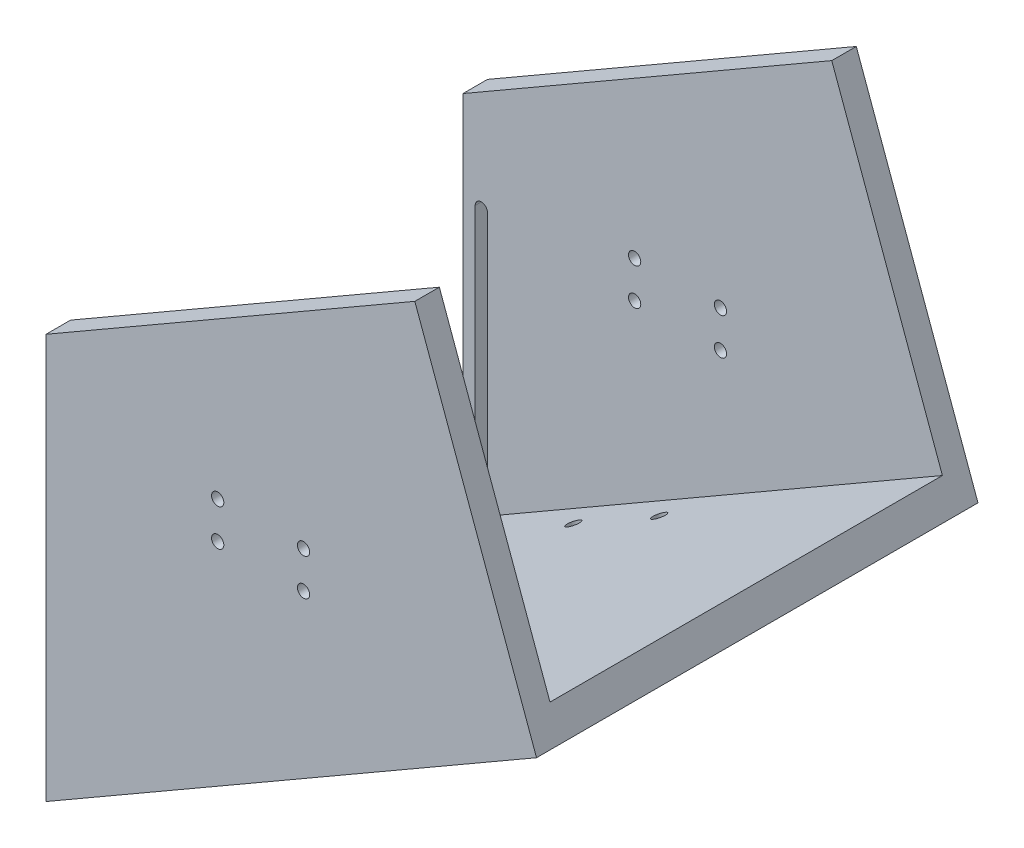
ISO-10303-21;
HEADER;
FILE_DESCRIPTION(('STEP AP214'),'2;1');
FILE_NAME('part.step','',(''),(''),'','','');
FILE_SCHEMA(('AUTOMOTIVE_DESIGN { 1 0 10303 214 1 1 1 1 }'));
ENDSEC;
DATA;
#1=APPLICATION_CONTEXT('core data for automotive mechanical design processes');
#2=APPLICATION_PROTOCOL_DEFINITION('international standard','automotive_design',2000,#1);
#3=PRODUCT_CONTEXT('',#1,'mechanical');
#4=PRODUCT('Part','Part','',(#3));
#5=PRODUCT_RELATED_PRODUCT_CATEGORY('part','',(#4));
#6=PRODUCT_DEFINITION_FORMATION('','',#4);
#7=PRODUCT_DEFINITION_CONTEXT('part definition',#1,'design');
#8=PRODUCT_DEFINITION('design','',#6,#7);
#9=PRODUCT_DEFINITION_SHAPE('','',#8);
#10=(LENGTH_UNIT() NAMED_UNIT(*) SI_UNIT(.MILLI.,.METRE.));
#11=(NAMED_UNIT(*) PLANE_ANGLE_UNIT() SI_UNIT($,.RADIAN.));
#12=(NAMED_UNIT(*) SI_UNIT($,.STERADIAN.) SOLID_ANGLE_UNIT());
#13=UNCERTAINTY_MEASURE_WITH_UNIT(LENGTH_MEASURE(1.E-05),#10,'distance_accuracy_value','');
#14=(GEOMETRIC_REPRESENTATION_CONTEXT(3) GLOBAL_UNCERTAINTY_ASSIGNED_CONTEXT((#13)) GLOBAL_UNIT_ASSIGNED_CONTEXT((#10,
#11,#12)) REPRESENTATION_CONTEXT('',''));
#15=CARTESIAN_POINT('',(0.,0.,0.));
#16=DIRECTION('',(0.,0.,1.));
#17=DIRECTION('',(1.,0.,0.));
#18=AXIS2_PLACEMENT_3D('',#15,#16,#17);
#19=CARTESIAN_POINT('',(0.,0.,80.));
#20=DIRECTION('',(0.,0.,-1.));
#21=DIRECTION('',(-1.,0.,0.));
#22=AXIS2_PLACEMENT_3D('',#19,#20,#21);
#23=PLANE('',#22);
#24=CARTESIAN_POINT('',(-130.,11.3480506849568,80.));
#25=DIRECTION('',(0.,0.,-1.));
#26=DIRECTION('',(-1.,0.,0.));
#27=AXIS2_PLACEMENT_3D('',#24,#25,#26);
#28=CIRCLE('',#27,2.5);
#29=CARTESIAN_POINT('',(-132.5,11.3480506849568,80.));
#30=VERTEX_POINT('',#29);
#31=EDGE_CURVE('E238',#30,#30,#28,.T.);
#32=ORIENTED_EDGE('',*,*,#31,.F.);
#33=EDGE_LOOP('',(#32));
#34=FACE_BOUND('',#33,.T.);
#35=CARTESIAN_POINT('',(-94.9999999999999,26.3480506849568,80.));
#36=DIRECTION('',(0.,0.,-1.));
#37=DIRECTION('',(-1.,0.,0.));
#38=AXIS2_PLACEMENT_3D('',#35,#36,#37);
#39=CIRCLE('',#38,2.5);
#40=CARTESIAN_POINT('',(-97.4999999999999,26.3480506849568,80.));
#41=VERTEX_POINT('',#40);
#42=EDGE_CURVE('E267',#41,#41,#39,.T.);
#43=ORIENTED_EDGE('',*,*,#42,.F.);
#44=EDGE_LOOP('',(#43));
#45=FACE_BOUND('',#44,.T.);
#46=CARTESIAN_POINT('',(-130.,26.3480506849568,80.));
#47=DIRECTION('',(0.,0.,-1.));
#48=DIRECTION('',(-1.,0.,0.));
#49=AXIS2_PLACEMENT_3D('',#46,#47,#48);
#50=CIRCLE('',#49,2.5);
#51=CARTESIAN_POINT('',(-132.5,26.3480506849568,80.));
#52=VERTEX_POINT('',#51);
#53=EDGE_CURVE('E263',#52,#52,#50,.T.);
#54=ORIENTED_EDGE('',*,*,#53,.F.);
#55=EDGE_LOOP('',(#54));
#56=FACE_BOUND('',#55,.T.);
#57=CARTESIAN_POINT('',(-94.9999999999999,11.3480506849568,80.));
#58=DIRECTION('',(0.,0.,-1.));
#59=DIRECTION('',(-1.,0.,0.));
#60=AXIS2_PLACEMENT_3D('',#57,#58,#59);
#61=CIRCLE('',#60,2.49999999999999);
#62=CARTESIAN_POINT('',(-97.4999999999999,11.3480506849568,80.));
#63=VERTEX_POINT('',#62);
#64=EDGE_CURVE('E258',#63,#63,#61,.T.);
#65=ORIENTED_EDGE('',*,*,#64,.F.);
#66=EDGE_LOOP('',(#65));
#67=FACE_BOUND('',#66,.T.);
#68=DIRECTION('',(-0.342020143325665,0.93969262078591,0.));
#69=VECTOR('',#68,1.);
#70=CARTESIAN_POINT('',(0.,0.,80.));
#71=LINE('',#70,#69);
#72=CARTESIAN_POINT('',(-4.511511995413,12.395277334996,80.));
#73=VERTEX_POINT('',#72);
#74=CARTESIAN_POINT('',(-49.6266319495432,136.348050684957,79.9999999999999));
#75=VERTEX_POINT('',#74);
#76=EDGE_CURVE('E304',#73,#75,#71,.T.);
#77=ORIENTED_EDGE('',*,*,#76,.F.);
#78=DIRECTION('',(0.866025403784436,0.500000000000004,0.));
#79=VECTOR('',#78,1.);
#80=CARTESIAN_POINT('',(0.,15.,80.));
#81=LINE('',#80,#79);
#82=CARTESIAN_POINT('',(-200.,-100.470053837926,80.));
#83=VERTEX_POINT('',#82);
#84=EDGE_CURVE('E389',#83,#73,#81,.T.);
#85=ORIENTED_EDGE('',*,*,#84,.F.);
#86=DIRECTION('',(0.,-1.,0.));
#87=VECTOR('',#86,1.);
#88=CARTESIAN_POINT('',(-200.,-100.470053837926,80.));
#89=LINE('',#88,#87);
#90=CARTESIAN_POINT('',(-200.,49.5299461620734,80.));
#91=VERTEX_POINT('',#90);
#92=EDGE_CURVE('E385',#91,#83,#89,.T.);
#93=ORIENTED_EDGE('',*,*,#92,.F.);
#94=DIRECTION('',(-0.866025403784436,-0.500000000000004,0.));
#95=VECTOR('',#94,1.);
#96=CARTESIAN_POINT('',(-200.,49.5299461620734,80.));
#97=LINE('',#96,#95);
#98=EDGE_CURVE('E382',#75,#91,#97,.T.);
#99=ORIENTED_EDGE('',*,*,#98,.F.);
#100=EDGE_LOOP('',(#77,#85,#93,#99));
#101=FACE_BOUND('',#100,.T.);
#102=DIRECTION('',(0.,1.,0.));
#103=VECTOR('',#102,1.);
#104=CARTESIAN_POINT('',(-190.,0.,80.));
#105=LINE('',#104,#103);
#106=CARTESIAN_POINT('',(-190.,-87.4796727811599,80.));
#107=VERTEX_POINT('',#106);
#108=CARTESIAN_POINT('',(-190.,12.5203272188401,80.));
#109=VERTEX_POINT('',#108);
#110=EDGE_CURVE('E218',#107,#109,#105,.T.);
#111=ORIENTED_EDGE('',*,*,#110,.T.);
#112=CARTESIAN_POINT('',(-192.5,12.5203272188401,80.));
#113=DIRECTION('',(0.,0.,-1.));
#114=DIRECTION('',(-1.,0.,0.));
#115=AXIS2_PLACEMENT_3D('',#112,#113,#114);
#116=CIRCLE('',#115,2.5);
#117=CARTESIAN_POINT('',(-195.,12.5203272188401,80.));
#118=VERTEX_POINT('',#117);
#119=EDGE_CURVE('E59',#109,#118,#116,.F.);
#120=ORIENTED_EDGE('',*,*,#119,.T.);
#121=DIRECTION('',(0.,-1.,0.));
#122=VECTOR('',#121,1.);
#123=CARTESIAN_POINT('',(-195.,0.,80.));
#124=LINE('',#123,#122);
#125=CARTESIAN_POINT('',(-195.,-87.4796727811599,80.));
#126=VERTEX_POINT('',#125);
#127=EDGE_CURVE('E226',#118,#126,#124,.T.);
#128=ORIENTED_EDGE('',*,*,#127,.T.);
#129=CARTESIAN_POINT('',(-192.5,-87.4796727811599,80.));
#130=DIRECTION('',(0.,0.,-1.));
#131=DIRECTION('',(-1.,0.,0.));
#132=AXIS2_PLACEMENT_3D('',#129,#130,#131);
#133=CIRCLE('',#132,2.50000000000003);
#134=EDGE_CURVE('E222',#126,#107,#133,.F.);
#135=ORIENTED_EDGE('',*,*,#134,.T.);
#136=EDGE_LOOP('',(#111,#120,#128,#135));
#137=FACE_BOUND('',#136,.T.);
#138=ADVANCED_FACE('F49',(#34,#45,#56,#67,#101,#137),#23,.T.);
#139=CARTESIAN_POINT('',(0.,15.,-90.));
#140=DIRECTION('',(0.,0.,-1.));
#141=DIRECTION('',(-1.,0.,0.));
#142=AXIS2_PLACEMENT_3D('',#139,#140,#141);
#143=PLANE('',#142);
#144=CARTESIAN_POINT('',(-130.,11.3480506849568,-90.));
#145=DIRECTION('',(0.,0.,-1.));
#146=DIRECTION('',(-1.,0.,0.));
#147=AXIS2_PLACEMENT_3D('',#144,#145,#146);
#148=CIRCLE('',#147,2.5);
#149=CARTESIAN_POINT('',(-132.5,11.3480506849568,-90.));
#150=VERTEX_POINT('',#149);
#151=EDGE_CURVE('E454',#150,#150,#148,.T.);
#152=ORIENTED_EDGE('',*,*,#151,.F.);
#153=EDGE_LOOP('',(#152));
#154=FACE_BOUND('',#153,.T.);
#155=CARTESIAN_POINT('',(-94.9999999999999,26.3480506849568,-90.));
#156=DIRECTION('',(0.,0.,-1.));
#157=DIRECTION('',(-1.,0.,0.));
#158=AXIS2_PLACEMENT_3D('',#155,#156,#157);
#159=CIRCLE('',#158,2.5);
#160=CARTESIAN_POINT('',(-97.4999999999999,26.3480506849568,-90.));
#161=VERTEX_POINT('',#160);
#162=EDGE_CURVE('E467',#161,#161,#159,.T.);
#163=ORIENTED_EDGE('',*,*,#162,.F.);
#164=EDGE_LOOP('',(#163));
#165=FACE_BOUND('',#164,.T.);
#166=CARTESIAN_POINT('',(-130.,26.3480506849568,-90.));
#167=DIRECTION('',(0.,0.,-1.));
#168=DIRECTION('',(-1.,0.,0.));
#169=AXIS2_PLACEMENT_3D('',#166,#167,#168);
#170=CIRCLE('',#169,2.5);
#171=CARTESIAN_POINT('',(-132.5,26.3480506849568,-90.));
#172=VERTEX_POINT('',#171);
#173=EDGE_CURVE('E468',#172,#172,#170,.T.);
#174=ORIENTED_EDGE('',*,*,#173,.F.);
#175=EDGE_LOOP('',(#174));
#176=FACE_BOUND('',#175,.T.);
#177=CARTESIAN_POINT('',(-94.9999999999999,11.3480506849568,-90.));
#178=DIRECTION('',(0.,0.,-1.));
#179=DIRECTION('',(-1.,0.,0.));
#180=AXIS2_PLACEMENT_3D('',#177,#178,#179);
#181=CIRCLE('',#180,2.49999999999999);
#182=CARTESIAN_POINT('',(-97.4999999999999,11.3480506849568,-90.));
#183=VERTEX_POINT('',#182);
#184=EDGE_CURVE('E451',#183,#183,#181,.T.);
#185=ORIENTED_EDGE('',*,*,#184,.F.);
#186=EDGE_LOOP('',(#185));
#187=FACE_BOUND('',#186,.T.);
#188=DIRECTION('',(0.342020143325665,-0.93969262078591,0.));
#189=VECTOR('',#188,1.);
#190=CARTESIAN_POINT('',(-49.6266319495432,136.348050684957,-90.));
#191=LINE('',#190,#189);
#192=CARTESIAN_POINT('',(-49.6266319495432,136.348050684957,-90.));
#193=VERTEX_POINT('',#192);
#194=CARTESIAN_POINT('',(0.,0.,-90.));
#195=VERTEX_POINT('',#194);
#196=EDGE_CURVE('E165',#193,#195,#191,.T.);
#197=ORIENTED_EDGE('',*,*,#196,.T.);
#198=DIRECTION('',(0.866025403784436,0.500000000000004,0.));
#199=VECTOR('',#198,1.);
#200=CARTESIAN_POINT('',(0.,0.,-90.));
#201=LINE('',#200,#199);
#202=CARTESIAN_POINT('',(-200.,-115.470053837926,-90.));
#203=VERTEX_POINT('',#202);
#204=EDGE_CURVE('E180',#203,#195,#201,.T.);
#205=ORIENTED_EDGE('',*,*,#204,.F.);
#206=DIRECTION('',(0.,-1.,0.));
#207=VECTOR('',#206,1.);
#208=CARTESIAN_POINT('',(-200.,-100.470053837926,-90.));
#209=LINE('',#208,#207);
#210=CARTESIAN_POINT('',(-200.,49.5299461620734,-90.));
#211=VERTEX_POINT('',#210);
#212=EDGE_CURVE('E191',#211,#203,#209,.T.);
#213=ORIENTED_EDGE('',*,*,#212,.F.);
#214=DIRECTION('',(-0.866025403784436,-0.500000000000004,0.));
#215=VECTOR('',#214,1.);
#216=CARTESIAN_POINT('',(-200.,49.5299461620734,-90.));
#217=LINE('',#216,#215);
#218=EDGE_CURVE('E181',#193,#211,#217,.T.);
#219=ORIENTED_EDGE('',*,*,#218,.F.);
#220=EDGE_LOOP('',(#197,#205,#213,#219));
#221=FACE_BOUND('',#220,.T.);
#222=ADVANCED_FACE('F51',(#154,#165,#176,#187,#221),#143,.T.);
#223=CARTESIAN_POINT('',(0.,15.,90.));
#224=DIRECTION('',(0.,0.,-1.));
#225=DIRECTION('',(-1.,0.,0.));
#226=AXIS2_PLACEMENT_3D('',#223,#224,#225);
#227=PLANE('',#226);
#228=CARTESIAN_POINT('',(-130.,11.3480506849568,90.));
#229=DIRECTION('',(0.,0.,-1.));
#230=DIRECTION('',(-1.,0.,0.));
#231=AXIS2_PLACEMENT_3D('',#228,#229,#230);
#232=CIRCLE('',#231,2.5);
#233=CARTESIAN_POINT('',(-132.5,11.3480506849568,90.));
#234=VERTEX_POINT('',#233);
#235=EDGE_CURVE('E460',#234,#234,#232,.T.);
#236=ORIENTED_EDGE('',*,*,#235,.T.);
#237=EDGE_LOOP('',(#236));
#238=FACE_BOUND('',#237,.T.);
#239=CARTESIAN_POINT('',(-94.9999999999999,26.3480506849568,90.));
#240=DIRECTION('',(0.,0.,-1.));
#241=DIRECTION('',(-1.,0.,0.));
#242=AXIS2_PLACEMENT_3D('',#239,#240,#241);
#243=CIRCLE('',#242,2.5);
#244=CARTESIAN_POINT('',(-97.4999999999999,26.3480506849568,90.));
#245=VERTEX_POINT('',#244);
#246=EDGE_CURVE('E463',#245,#245,#243,.T.);
#247=ORIENTED_EDGE('',*,*,#246,.T.);
#248=EDGE_LOOP('',(#247));
#249=FACE_BOUND('',#248,.T.);
#250=CARTESIAN_POINT('',(-130.,26.3480506849568,90.));
#251=DIRECTION('',(0.,0.,-1.));
#252=DIRECTION('',(-1.,0.,0.));
#253=AXIS2_PLACEMENT_3D('',#250,#251,#252);
#254=CIRCLE('',#253,2.5);
#255=CARTESIAN_POINT('',(-132.5,26.3480506849568,90.));
#256=VERTEX_POINT('',#255);
#257=EDGE_CURVE('E475',#256,#256,#254,.T.);
#258=ORIENTED_EDGE('',*,*,#257,.T.);
#259=EDGE_LOOP('',(#258));
#260=FACE_BOUND('',#259,.T.);
#261=CARTESIAN_POINT('',(-94.9999999999999,11.3480506849568,90.));
#262=DIRECTION('',(0.,0.,-1.));
#263=DIRECTION('',(-1.,0.,0.));
#264=AXIS2_PLACEMENT_3D('',#261,#262,#263);
#265=CIRCLE('',#264,2.49999999999999);
#266=CARTESIAN_POINT('',(-97.4999999999999,11.3480506849568,90.));
#267=VERTEX_POINT('',#266);
#268=EDGE_CURVE('E259',#267,#267,#265,.T.);
#269=ORIENTED_EDGE('',*,*,#268,.T.);
#270=EDGE_LOOP('',(#269));
#271=FACE_BOUND('',#270,.T.);
#272=DIRECTION('',(0.866025403784436,0.500000000000004,0.));
#273=VECTOR('',#272,1.);
#274=CARTESIAN_POINT('',(0.,0.,90.));
#275=LINE('',#274,#273);
#276=CARTESIAN_POINT('',(-200.,-115.470053837926,90.));
#277=VERTEX_POINT('',#276);
#278=CARTESIAN_POINT('',(0.,0.,90.));
#279=VERTEX_POINT('',#278);
#280=EDGE_CURVE('E195',#277,#279,#275,.T.);
#281=ORIENTED_EDGE('',*,*,#280,.T.);
#282=DIRECTION('',(0.342020143325665,-0.93969262078591,0.));
#283=VECTOR('',#282,1.);
#284=CARTESIAN_POINT('',(-49.6266319495432,136.348050684957,90.));
#285=LINE('',#284,#283);
#286=CARTESIAN_POINT('',(-49.6266319495432,136.348050684957,90.));
#287=VERTEX_POINT('',#286);
#288=EDGE_CURVE('E167',#287,#279,#285,.T.);
#289=ORIENTED_EDGE('',*,*,#288,.F.);
#290=DIRECTION('',(-0.866025403784436,-0.500000000000004,0.));
#291=VECTOR('',#290,1.);
#292=CARTESIAN_POINT('',(-200.,49.5299461620734,90.));
#293=LINE('',#292,#291);
#294=CARTESIAN_POINT('',(-200.,49.5299461620734,90.));
#295=VERTEX_POINT('',#294);
#296=EDGE_CURVE('E381',#287,#295,#293,.T.);
#297=ORIENTED_EDGE('',*,*,#296,.T.);
#298=DIRECTION('',(0.,-1.,0.));
#299=VECTOR('',#298,1.);
#300=CARTESIAN_POINT('',(-200.,-100.470053837926,90.));
#301=LINE('',#300,#299);
#302=EDGE_CURVE('E190',#295,#277,#301,.T.);
#303=ORIENTED_EDGE('',*,*,#302,.T.);
#304=EDGE_LOOP('',(#281,#289,#297,#303));
#305=FACE_BOUND('',#304,.T.);
#306=ADVANCED_FACE('F399',(#238,#249,#260,#271,#305),#227,.F.);
#307=CARTESIAN_POINT('',(0.,15.,90.));
#308=DIRECTION('',(0.500000000000004,-0.866025403784436,0.));
#309=DIRECTION('',(0.866025403784436,0.500000000000004,0.));
#310=AXIS2_PLACEMENT_3D('',#307,#308,#309);
#311=PLANE('',#310);
#312=CARTESIAN_POINT('',(-107.5,-47.0651539378855,-67.5));
#313=DIRECTION('',(0.500000000000004,-0.866025403784436,0.));
#314=DIRECTION('',(0.866025403784436,0.500000000000004,0.));
#315=AXIS2_PLACEMENT_3D('',#312,#313,#314);
#316=ELLIPSE('',#315,2.88675134594813,2.5);
#317=CARTESIAN_POINT('',(-105.,-45.6217782649114,-67.5));
#318=VERTEX_POINT('',#317);
#319=EDGE_CURVE('E253',#318,#318,#316,.T.);
#320=ORIENTED_EDGE('',*,*,#319,.T.);
#321=EDGE_LOOP('',(#320));
#322=FACE_BOUND('',#321,.T.);
#323=CARTESIAN_POINT('',(-142.5,-67.2724133595226,67.5));
#324=DIRECTION('',(0.500000000000004,-0.866025403784436,0.));
#325=DIRECTION('',(0.866025403784436,0.500000000000004,0.));
#326=AXIS2_PLACEMENT_3D('',#323,#324,#325);
#327=ELLIPSE('',#326,2.88675134594813,2.5);
#328=CARTESIAN_POINT('',(-140.,-65.8290376865485,67.5));
#329=VERTEX_POINT('',#328);
#330=EDGE_CURVE('E248',#329,#329,#327,.T.);
#331=ORIENTED_EDGE('',*,*,#330,.T.);
#332=EDGE_LOOP('',(#331));
#333=FACE_BOUND('',#332,.T.);
#334=CARTESIAN_POINT('',(-107.5,-47.0651539378855,67.5));
#335=DIRECTION('',(0.500000000000004,-0.866025403784436,0.));
#336=DIRECTION('',(0.866025403784436,0.500000000000004,0.));
#337=AXIS2_PLACEMENT_3D('',#334,#335,#336);
#338=ELLIPSE('',#337,2.88675134594813,2.5);
#339=CARTESIAN_POINT('',(-105.,-45.6217782649114,67.5));
#340=VERTEX_POINT('',#339);
#341=EDGE_CURVE('E243',#340,#340,#338,.T.);
#342=ORIENTED_EDGE('',*,*,#341,.T.);
#343=EDGE_LOOP('',(#342));
#344=FACE_BOUND('',#343,.T.);
#345=CARTESIAN_POINT('',(-142.5,-67.2724133595226,-67.5));
#346=DIRECTION('',(0.500000000000004,-0.866025403784436,0.));
#347=DIRECTION('',(0.866025403784436,0.500000000000004,0.));
#348=AXIS2_PLACEMENT_3D('',#345,#346,#347);
#349=ELLIPSE('',#348,2.88675134594813,2.5);
#350=CARTESIAN_POINT('',(-140.,-65.8290376865485,-67.5));
#351=VERTEX_POINT('',#350);
#352=EDGE_CURVE('E237',#351,#351,#349,.T.);
#353=ORIENTED_EDGE('',*,*,#352,.T.);
#354=EDGE_LOOP('',(#353));
#355=FACE_BOUND('',#354,.T.);
#356=ORIENTED_EDGE('',*,*,#84,.T.);
#357=DIRECTION('',(0.,0.,-1.));
#358=VECTOR('',#357,1.);
#359=CARTESIAN_POINT('',(-4.511511995413,12.395277334996,90.));
#360=LINE('',#359,#358);
#361=CARTESIAN_POINT('',(-4.511511995413,12.395277334996,-80.));
#362=VERTEX_POINT('',#361);
#363=EDGE_CURVE('E300',#73,#362,#360,.T.);
#364=ORIENTED_EDGE('',*,*,#363,.T.);
#365=DIRECTION('',(0.866025403784436,0.500000000000004,0.));
#366=VECTOR('',#365,1.);
#367=CARTESIAN_POINT('',(0.,15.,-80.));
#368=LINE('',#367,#366);
#369=CARTESIAN_POINT('',(-200.,-100.470053837926,-80.));
#370=VERTEX_POINT('',#369);
#371=EDGE_CURVE('E365',#370,#362,#368,.T.);
#372=ORIENTED_EDGE('',*,*,#371,.F.);
#373=DIRECTION('',(0.,0.,-1.));
#374=VECTOR('',#373,1.);
#375=CARTESIAN_POINT('',(-200.,-100.470053837926,90.));
#376=LINE('',#375,#374);
#377=EDGE_CURVE('E174',#83,#370,#376,.T.);
#378=ORIENTED_EDGE('',*,*,#377,.F.);
#379=EDGE_LOOP('',(#356,#364,#372,#378));
#380=FACE_BOUND('',#379,.T.);
#381=ADVANCED_FACE('F416',(#322,#333,#344,#355,#380),#311,.F.);
#382=CARTESIAN_POINT('',(-200.,-100.470053837926,90.));
#383=DIRECTION('',(1.,0.,0.));
#384=DIRECTION('',(0.,1.,0.));
#385=AXIS2_PLACEMENT_3D('',#382,#383,#384);
#386=PLANE('',#385);
#387=ORIENTED_EDGE('',*,*,#212,.T.);
#388=DIRECTION('',(0.,0.,-1.));
#389=VECTOR('',#388,1.);
#390=CARTESIAN_POINT('',(-200.,-115.470053837926,90.));
#391=LINE('',#390,#389);
#392=EDGE_CURVE('E188',#277,#203,#391,.T.);
#393=ORIENTED_EDGE('',*,*,#392,.F.);
#394=ORIENTED_EDGE('',*,*,#302,.F.);
#395=DIRECTION('',(0.,0.,1.));
#396=VECTOR('',#395,1.);
#397=CARTESIAN_POINT('',(-200.,49.5299461620734,80.));
#398=LINE('',#397,#396);
#399=EDGE_CURVE('E197',#91,#295,#398,.T.);
#400=ORIENTED_EDGE('',*,*,#399,.F.);
#401=ORIENTED_EDGE('',*,*,#92,.T.);
#402=ORIENTED_EDGE('',*,*,#377,.T.);
#403=DIRECTION('',(0.,-1.,0.));
#404=VECTOR('',#403,1.);
#405=CARTESIAN_POINT('',(-200.,-100.470053837926,-80.));
#406=LINE('',#405,#404);
#407=CARTESIAN_POINT('',(-200.,49.5299461620734,-80.));
#408=VERTEX_POINT('',#407);
#409=EDGE_CURVE('E369',#408,#370,#406,.T.);
#410=ORIENTED_EDGE('',*,*,#409,.F.);
#411=DIRECTION('',(0.,0.,-1.));
#412=VECTOR('',#411,1.);
#413=CARTESIAN_POINT('',(-200.,49.5299461620734,-80.));
#414=LINE('',#413,#412);
#415=EDGE_CURVE('E375',#408,#211,#414,.T.);
#416=ORIENTED_EDGE('',*,*,#415,.T.);
#417=EDGE_LOOP('',(#387,#393,#394,#400,#401,#402,#410,#416));
#418=FACE_BOUND('',#417,.T.);
#419=ADVANCED_FACE('F404',(#418),#386,.F.);
#420=CARTESIAN_POINT('',(0.,0.,90.));
#421=DIRECTION('',(-0.500000000000004,0.866025403784436,0.));
#422=DIRECTION('',(-0.866025403784436,-0.500000000000004,0.));
#423=AXIS2_PLACEMENT_3D('',#420,#421,#422);
#424=PLANE('',#423);
#425=CARTESIAN_POINT('',(-107.5,-62.0651539378855,-67.5));
#426=DIRECTION('',(-0.500000000000004,0.866025403784436,0.));
#427=DIRECTION('',(0.866025403784436,0.500000000000004,0.));
#428=AXIS2_PLACEMENT_3D('',#425,#426,#427);
#429=ELLIPSE('',#428,2.88675134594813,2.5);
#430=CARTESIAN_POINT('',(-105.,-60.6217782649114,-67.5));
#431=VERTEX_POINT('',#430);
#432=EDGE_CURVE('E249',#431,#431,#429,.T.);
#433=ORIENTED_EDGE('',*,*,#432,.T.);
#434=EDGE_LOOP('',(#433));
#435=FACE_BOUND('',#434,.T.);
#436=CARTESIAN_POINT('',(-142.5,-82.2724133595226,67.5));
#437=DIRECTION('',(-0.500000000000004,0.866025403784436,0.));
#438=DIRECTION('',(0.866025403784436,0.500000000000004,0.));
#439=AXIS2_PLACEMENT_3D('',#436,#437,#438);
#440=ELLIPSE('',#439,2.88675134594813,2.5);
#441=CARTESIAN_POINT('',(-140.,-80.8290376865485,67.5));
#442=VERTEX_POINT('',#441);
#443=EDGE_CURVE('E244',#442,#442,#440,.T.);
#444=ORIENTED_EDGE('',*,*,#443,.T.);
#445=EDGE_LOOP('',(#444));
#446=FACE_BOUND('',#445,.T.);
#447=CARTESIAN_POINT('',(-107.5,-62.0651539378855,67.5));
#448=DIRECTION('',(-0.500000000000004,0.866025403784436,0.));
#449=DIRECTION('',(0.866025403784436,0.500000000000004,0.));
#450=AXIS2_PLACEMENT_3D('',#447,#448,#449);
#451=ELLIPSE('',#450,2.88675134594813,2.5);
#452=CARTESIAN_POINT('',(-105.,-60.6217782649114,67.5));
#453=VERTEX_POINT('',#452);
#454=EDGE_CURVE('E239',#453,#453,#451,.T.);
#455=ORIENTED_EDGE('',*,*,#454,.T.);
#456=EDGE_LOOP('',(#455));
#457=FACE_BOUND('',#456,.T.);
#458=CARTESIAN_POINT('',(-142.5,-82.2724133595226,-67.5));
#459=DIRECTION('',(-0.500000000000004,0.866025403784436,0.));
#460=DIRECTION('',(0.866025403784436,0.500000000000004,0.));
#461=AXIS2_PLACEMENT_3D('',#458,#459,#460);
#462=ELLIPSE('',#461,2.88675134594813,2.5);
#463=CARTESIAN_POINT('',(-140.,-80.8290376865485,-67.5));
#464=VERTEX_POINT('',#463);
#465=EDGE_CURVE('E233',#464,#464,#462,.T.);
#466=ORIENTED_EDGE('',*,*,#465,.T.);
#467=EDGE_LOOP('',(#466));
#468=FACE_BOUND('',#467,.T.);
#469=ORIENTED_EDGE('',*,*,#204,.T.);
#470=DIRECTION('',(0.,0.,1.));
#471=VECTOR('',#470,1.);
#472=CARTESIAN_POINT('',(0.,0.,0.));
#473=LINE('',#472,#471);
#474=EDGE_CURVE('E162',#195,#279,#473,.T.);
#475=ORIENTED_EDGE('',*,*,#474,.T.);
#476=ORIENTED_EDGE('',*,*,#280,.F.);
#477=ORIENTED_EDGE('',*,*,#392,.T.);
#478=EDGE_LOOP('',(#469,#475,#476,#477));
#479=FACE_BOUND('',#478,.T.);
#480=ADVANCED_FACE('F186',(#435,#446,#457,#468,#479),#424,.F.);
#481=CARTESIAN_POINT('',(-200.,49.5299461620734,80.));
#482=DIRECTION('',(-0.500000000000004,0.866025403784436,0.));
#483=DIRECTION('',(-0.866025403784436,-0.500000000000005,0.));
#484=AXIS2_PLACEMENT_3D('',#481,#482,#483);
#485=PLANE('',#484);
#486=DIRECTION('',(0.,0.,1.));
#487=VECTOR('',#486,1.);
#488=CARTESIAN_POINT('',(-49.6266319495432,136.348050684957,-90.));
#489=LINE('',#488,#487);
#490=EDGE_CURVE('E183',#75,#287,#489,.T.);
#491=ORIENTED_EDGE('',*,*,#490,.F.);
#492=ORIENTED_EDGE('',*,*,#98,.T.);
#493=ORIENTED_EDGE('',*,*,#399,.T.);
#494=ORIENTED_EDGE('',*,*,#296,.F.);
#495=EDGE_LOOP('',(#491,#492,#493,#494));
#496=FACE_BOUND('',#495,.T.);
#497=ADVANCED_FACE('F424',(#496),#485,.T.);
#498=CARTESIAN_POINT('',(-200.,49.5299461620734,-80.));
#499=DIRECTION('',(0.500000000000004,-0.866025403784436,0.));
#500=DIRECTION('',(0.866025403784436,0.500000000000005,0.));
#501=AXIS2_PLACEMENT_3D('',#498,#499,#500);
#502=PLANE('',#501);
#503=DIRECTION('',(-0.866025403784436,-0.500000000000004,0.));
#504=VECTOR('',#503,1.);
#505=CARTESIAN_POINT('',(-200.,49.5299461620734,-80.));
#506=LINE('',#505,#504);
#507=CARTESIAN_POINT('',(-49.626631949543,136.348050684956,-80.));
#508=VERTEX_POINT('',#507);
#509=EDGE_CURVE('E372',#508,#408,#506,.T.);
#510=ORIENTED_EDGE('',*,*,#509,.F.);
#511=EDGE_CURVE('E66',#193,#508,#489,.T.);
#512=ORIENTED_EDGE('',*,*,#511,.F.);
#513=ORIENTED_EDGE('',*,*,#218,.T.);
#514=ORIENTED_EDGE('',*,*,#415,.F.);
#515=EDGE_LOOP('',(#510,#512,#513,#514));
#516=FACE_BOUND('',#515,.T.);
#517=ADVANCED_FACE('F409',(#516),#502,.F.);
#518=CARTESIAN_POINT('',(0.,0.,-80.));
#519=DIRECTION('',(0.,0.,1.));
#520=DIRECTION('',(-1.,0.,0.));
#521=AXIS2_PLACEMENT_3D('',#518,#519,#520);
#522=PLANE('',#521);
#523=CARTESIAN_POINT('',(-130.,11.3480506849568,-80.));
#524=DIRECTION('',(0.,0.,1.));
#525=DIRECTION('',(1.,0.,0.));
#526=AXIS2_PLACEMENT_3D('',#523,#524,#525);
#527=CIRCLE('',#526,2.5);
#528=CARTESIAN_POINT('',(-127.5,11.3480506849568,-80.));
#529=VERTEX_POINT('',#528);
#530=EDGE_CURVE('E53',#529,#529,#527,.T.);
#531=ORIENTED_EDGE('',*,*,#530,.F.);
#532=EDGE_LOOP('',(#531));
#533=FACE_BOUND('',#532,.T.);
#534=CARTESIAN_POINT('',(-94.9999999999999,26.3480506849568,-80.));
#535=DIRECTION('',(0.,0.,1.));
#536=DIRECTION('',(1.,0.,0.));
#537=AXIS2_PLACEMENT_3D('',#534,#535,#536);
#538=CIRCLE('',#537,2.5);
#539=CARTESIAN_POINT('',(-92.4999999999999,26.3480506849568,-80.));
#540=VERTEX_POINT('',#539);
#541=EDGE_CURVE('E264',#540,#540,#538,.T.);
#542=ORIENTED_EDGE('',*,*,#541,.F.);
#543=EDGE_LOOP('',(#542));
#544=FACE_BOUND('',#543,.T.);
#545=CARTESIAN_POINT('',(-130.,26.3480506849568,-80.));
#546=DIRECTION('',(0.,0.,1.));
#547=DIRECTION('',(1.,0.,0.));
#548=AXIS2_PLACEMENT_3D('',#545,#546,#547);
#549=CIRCLE('',#548,2.5);
#550=CARTESIAN_POINT('',(-127.5,26.3480506849568,-80.));
#551=VERTEX_POINT('',#550);
#552=EDGE_CURVE('E260',#551,#551,#549,.T.);
#553=ORIENTED_EDGE('',*,*,#552,.F.);
#554=EDGE_LOOP('',(#553));
#555=FACE_BOUND('',#554,.T.);
#556=CARTESIAN_POINT('',(-94.9999999999999,11.3480506849568,-80.));
#557=DIRECTION('',(0.,0.,1.));
#558=DIRECTION('',(1.,0.,0.));
#559=AXIS2_PLACEMENT_3D('',#556,#557,#558);
#560=CIRCLE('',#559,2.49999999999999);
#561=CARTESIAN_POINT('',(-92.5,11.3480506849568,-80.));
#562=VERTEX_POINT('',#561);
#563=EDGE_CURVE('E254',#562,#562,#560,.T.);
#564=ORIENTED_EDGE('',*,*,#563,.F.);
#565=EDGE_LOOP('',(#564));
#566=FACE_BOUND('',#565,.T.);
#567=DIRECTION('',(0.342020143325665,-0.93969262078591,0.));
#568=VECTOR('',#567,1.);
#569=CARTESIAN_POINT('',(0.,0.,-80.));
#570=LINE('',#569,#568);
#571=EDGE_CURVE('E12',#508,#362,#570,.T.);
#572=ORIENTED_EDGE('',*,*,#571,.F.);
#573=ORIENTED_EDGE('',*,*,#509,.T.);
#574=ORIENTED_EDGE('',*,*,#409,.T.);
#575=ORIENTED_EDGE('',*,*,#371,.T.);
#576=EDGE_LOOP('',(#572,#573,#574,#575));
#577=FACE_BOUND('',#576,.T.);
#578=CARTESIAN_POINT('',(-192.5,12.5203272188401,-80.));
#579=DIRECTION('',(0.,0.,1.));
#580=DIRECTION('',(1.,0.,0.));
#581=AXIS2_PLACEMENT_3D('',#578,#579,#580);
#582=CIRCLE('',#581,2.5);
#583=CARTESIAN_POINT('',(-190.,12.5203272188401,-80.));
#584=VERTEX_POINT('',#583);
#585=CARTESIAN_POINT('',(-195.,12.5203272188401,-80.));
#586=VERTEX_POINT('',#585);
#587=EDGE_CURVE('E214',#584,#586,#582,.T.);
#588=ORIENTED_EDGE('',*,*,#587,.F.);
#589=DIRECTION('',(0.,1.,0.));
#590=VECTOR('',#589,1.);
#591=CARTESIAN_POINT('',(-190.,0.,-80.));
#592=LINE('',#591,#590);
#593=CARTESIAN_POINT('',(-190.,-87.4796727811599,-80.));
#594=VERTEX_POINT('',#593);
#595=EDGE_CURVE('E211',#594,#584,#592,.T.);
#596=ORIENTED_EDGE('',*,*,#595,.F.);
#597=CARTESIAN_POINT('',(-192.5,-87.4796727811599,-80.));
#598=DIRECTION('',(0.,0.,1.));
#599=DIRECTION('',(1.,0.,0.));
#600=AXIS2_PLACEMENT_3D('',#597,#598,#599);
#601=CIRCLE('',#600,2.50000000000003);
#602=CARTESIAN_POINT('',(-195.,-87.4796727811599,-80.));
#603=VERTEX_POINT('',#602);
#604=EDGE_CURVE('E208',#603,#594,#601,.T.);
#605=ORIENTED_EDGE('',*,*,#604,.F.);
#606=DIRECTION('',(0.,-1.,0.));
#607=VECTOR('',#606,1.);
#608=CARTESIAN_POINT('',(-195.,0.,-80.));
#609=LINE('',#608,#607);
#610=EDGE_CURVE('E173',#586,#603,#609,.T.);
#611=ORIENTED_EDGE('',*,*,#610,.F.);
#612=EDGE_LOOP('',(#588,#596,#605,#611));
#613=FACE_BOUND('',#612,.T.);
#614=ADVANCED_FACE('F411',(#533,#544,#555,#566,#577,#613),#522,.T.);
#615=CARTESIAN_POINT('',(-192.5,12.5203272188401,-85.));
#616=DIRECTION('',(0.,0.,1.));
#617=DIRECTION('',(1.,0.,0.));
#618=AXIS2_PLACEMENT_3D('',#615,#616,#617);
#619=CYLINDRICAL_SURFACE('',#618,2.5);
#620=ORIENTED_EDGE('',*,*,#587,.T.);
#621=DIRECTION('',(0.,0.,1.));
#622=VECTOR('',#621,1.);
#623=CARTESIAN_POINT('',(-195.,12.5203272188401,-85.));
#624=LINE('',#623,#622);
#625=CARTESIAN_POINT('',(-195.,12.5203272188401,-85.));
#626=VERTEX_POINT('',#625);
#627=EDGE_CURVE('E350',#626,#586,#624,.T.);
#628=ORIENTED_EDGE('',*,*,#627,.F.);
#629=CARTESIAN_POINT('',(-192.5,12.5203272188401,-85.));
#630=DIRECTION('',(0.,0.,1.));
#631=DIRECTION('',(1.,0.,0.));
#632=AXIS2_PLACEMENT_3D('',#629,#630,#631);
#633=CIRCLE('',#632,2.5);
#634=CARTESIAN_POINT('',(-190.,12.5203272188401,-85.));
#635=VERTEX_POINT('',#634);
#636=EDGE_CURVE('E324',#635,#626,#633,.T.);
#637=ORIENTED_EDGE('',*,*,#636,.F.);
#638=DIRECTION('',(0.,0.,1.));
#639=VECTOR('',#638,1.);
#640=CARTESIAN_POINT('',(-190.,12.5203272188401,-85.));
#641=LINE('',#640,#639);
#642=EDGE_CURVE('E351',#635,#584,#641,.T.);
#643=ORIENTED_EDGE('',*,*,#642,.T.);
#644=EDGE_LOOP('',(#620,#628,#637,#643));
#645=FACE_BOUND('',#644,.T.);
#646=ADVANCED_FACE('F435',(#645),#619,.F.);
#647=CARTESIAN_POINT('',(-190.,12.5203272188401,-85.));
#648=DIRECTION('',(1.,0.,0.));
#649=DIRECTION('',(0.,1.,0.));
#650=AXIS2_PLACEMENT_3D('',#647,#648,#649);
#651=PLANE('',#650);
#652=ORIENTED_EDGE('',*,*,#595,.T.);
#653=ORIENTED_EDGE('',*,*,#642,.F.);
#654=DIRECTION('',(0.,1.,0.));
#655=VECTOR('',#654,1.);
#656=CARTESIAN_POINT('',(-190.,12.5203272188401,-85.));
#657=LINE('',#656,#655);
#658=CARTESIAN_POINT('',(-190.,-87.4796727811599,-85.));
#659=VERTEX_POINT('',#658);
#660=EDGE_CURVE('E346',#659,#635,#657,.T.);
#661=ORIENTED_EDGE('',*,*,#660,.F.);
#662=DIRECTION('',(0.,0.,1.));
#663=VECTOR('',#662,1.);
#664=CARTESIAN_POINT('',(-190.,-87.4796727811599,-85.));
#665=LINE('',#664,#663);
#666=EDGE_CURVE('E355',#659,#594,#665,.T.);
#667=ORIENTED_EDGE('',*,*,#666,.T.);
#668=EDGE_LOOP('',(#652,#653,#661,#667));
#669=FACE_BOUND('',#668,.T.);
#670=ADVANCED_FACE('F573',(#669),#651,.F.);
#671=CARTESIAN_POINT('',(-192.5,-87.4796727811599,-85.));
#672=DIRECTION('',(0.,0.,1.));
#673=DIRECTION('',(1.,0.,0.));
#674=AXIS2_PLACEMENT_3D('',#671,#672,#673);
#675=CYLINDRICAL_SURFACE('',#674,2.50000000000003);
#676=ORIENTED_EDGE('',*,*,#604,.T.);
#677=ORIENTED_EDGE('',*,*,#666,.F.);
#678=CARTESIAN_POINT('',(-192.5,-87.4796727811599,-85.));
#679=DIRECTION('',(0.,0.,1.));
#680=DIRECTION('',(1.,0.,0.));
#681=AXIS2_PLACEMENT_3D('',#678,#679,#680);
#682=CIRCLE('',#681,2.50000000000003);
#683=CARTESIAN_POINT('',(-195.,-87.4796727811599,-85.));
#684=VERTEX_POINT('',#683);
#685=EDGE_CURVE('E342',#684,#659,#682,.T.);
#686=ORIENTED_EDGE('',*,*,#685,.F.);
#687=DIRECTION('',(0.,0.,1.));
#688=VECTOR('',#687,1.);
#689=CARTESIAN_POINT('',(-195.,-87.4796727811599,-85.));
#690=LINE('',#689,#688);
#691=EDGE_CURVE('E359',#684,#603,#690,.T.);
#692=ORIENTED_EDGE('',*,*,#691,.T.);
#693=EDGE_LOOP('',(#676,#677,#686,#692));
#694=FACE_BOUND('',#693,.T.);
#695=ADVANCED_FACE('F576',(#694),#675,.F.);
#696=CARTESIAN_POINT('',(-195.,12.5203272188401,-85.));
#697=DIRECTION('',(-1.,0.,0.));
#698=DIRECTION('',(0.,-1.,0.));
#699=AXIS2_PLACEMENT_3D('',#696,#697,#698);
#700=PLANE('',#699);
#701=ORIENTED_EDGE('',*,*,#610,.T.);
#702=ORIENTED_EDGE('',*,*,#691,.F.);
#703=DIRECTION('',(0.,-1.,0.));
#704=VECTOR('',#703,1.);
#705=CARTESIAN_POINT('',(-195.,12.5203272188401,-85.));
#706=LINE('',#705,#704);
#707=EDGE_CURVE('E338',#626,#684,#706,.T.);
#708=ORIENTED_EDGE('',*,*,#707,.F.);
#709=ORIENTED_EDGE('',*,*,#627,.T.);
#710=EDGE_LOOP('',(#701,#702,#708,#709));
#711=FACE_BOUND('',#710,.T.);
#712=ADVANCED_FACE('F571',(#711),#700,.F.);
#713=CARTESIAN_POINT('',(-192.5,12.5203272188401,-85.));
#714=DIRECTION('',(0.,0.,1.));
#715=DIRECTION('',(1.,0.,0.));
#716=AXIS2_PLACEMENT_3D('',#713,#714,#715);
#717=PLANE('',#716);
#718=ORIENTED_EDGE('',*,*,#636,.T.);
#719=ORIENTED_EDGE('',*,*,#707,.T.);
#720=ORIENTED_EDGE('',*,*,#685,.T.);
#721=ORIENTED_EDGE('',*,*,#660,.T.);
#722=EDGE_LOOP('',(#718,#719,#720,#721));
#723=FACE_BOUND('',#722,.T.);
#724=ADVANCED_FACE('F567',(#723),#717,.T.);
#725=CARTESIAN_POINT('',(-192.5,12.5203272188401,85.));
#726=DIRECTION('',(0.,0.,-1.));
#727=DIRECTION('',(-1.,0.,0.));
#728=AXIS2_PLACEMENT_3D('',#725,#726,#727);
#729=CYLINDRICAL_SURFACE('',#728,2.5);
#730=DIRECTION('',(0.,0.,-1.));
#731=VECTOR('',#730,1.);
#732=CARTESIAN_POINT('',(-190.,12.5203272188401,85.));
#733=LINE('',#732,#731);
#734=CARTESIAN_POINT('',(-190.,12.5203272188401,85.));
#735=VERTEX_POINT('',#734);
#736=EDGE_CURVE('E74',#735,#109,#733,.T.);
#737=ORIENTED_EDGE('',*,*,#736,.F.);
#738=CARTESIAN_POINT('',(-192.5,12.5203272188401,85.));
#739=DIRECTION('',(0.,0.,1.));
#740=DIRECTION('',(1.,0.,0.));
#741=AXIS2_PLACEMENT_3D('',#738,#739,#740);
#742=CIRCLE('',#741,2.5);
#743=CARTESIAN_POINT('',(-195.,12.5203272188401,85.));
#744=VERTEX_POINT('',#743);
#745=EDGE_CURVE('E307',#735,#744,#742,.T.);
#746=ORIENTED_EDGE('',*,*,#745,.T.);
#747=DIRECTION('',(0.,0.,-1.));
#748=VECTOR('',#747,1.);
#749=CARTESIAN_POINT('',(-195.,12.5203272188401,85.));
#750=LINE('',#749,#748);
#751=EDGE_CURVE('E320',#744,#118,#750,.T.);
#752=ORIENTED_EDGE('',*,*,#751,.T.);
#753=ORIENTED_EDGE('',*,*,#119,.F.);
#754=EDGE_LOOP('',(#737,#746,#752,#753));
#755=FACE_BOUND('',#754,.T.);
#756=ADVANCED_FACE('F558',(#755),#729,.F.);
#757=CARTESIAN_POINT('',(-195.,12.5203272188401,85.));
#758=DIRECTION('',(1.,0.,0.));
#759=DIRECTION('',(0.,1.,0.));
#760=AXIS2_PLACEMENT_3D('',#757,#758,#759);
#761=PLANE('',#760);
#762=ORIENTED_EDGE('',*,*,#751,.F.);
#763=DIRECTION('',(0.,-1.,0.));
#764=VECTOR('',#763,1.);
#765=CARTESIAN_POINT('',(-195.,12.5203272188401,85.));
#766=LINE('',#765,#764);
#767=CARTESIAN_POINT('',(-195.,-87.4796727811599,85.));
#768=VERTEX_POINT('',#767);
#769=EDGE_CURVE('E317',#744,#768,#766,.T.);
#770=ORIENTED_EDGE('',*,*,#769,.T.);
#771=DIRECTION('',(0.,0.,-1.));
#772=VECTOR('',#771,1.);
#773=CARTESIAN_POINT('',(-195.,-87.4796727811599,85.));
#774=LINE('',#773,#772);
#775=EDGE_CURVE('E325',#768,#126,#774,.T.);
#776=ORIENTED_EDGE('',*,*,#775,.T.);
#777=ORIENTED_EDGE('',*,*,#127,.F.);
#778=EDGE_LOOP('',(#762,#770,#776,#777));
#779=FACE_BOUND('',#778,.T.);
#780=ADVANCED_FACE('F554',(#779),#761,.T.);
#781=CARTESIAN_POINT('',(-192.5,-87.4796727811599,85.));
#782=DIRECTION('',(0.,0.,-1.));
#783=DIRECTION('',(-1.,0.,0.));
#784=AXIS2_PLACEMENT_3D('',#781,#782,#783);
#785=CYLINDRICAL_SURFACE('',#784,2.50000000000003);
#786=ORIENTED_EDGE('',*,*,#775,.F.);
#787=CARTESIAN_POINT('',(-192.5,-87.4796727811599,85.));
#788=DIRECTION('',(0.,0.,1.));
#789=DIRECTION('',(1.,0.,0.));
#790=AXIS2_PLACEMENT_3D('',#787,#788,#789);
#791=CIRCLE('',#790,2.50000000000003);
#792=CARTESIAN_POINT('',(-190.,-87.4796727811599,85.));
#793=VERTEX_POINT('',#792);
#794=EDGE_CURVE('E314',#768,#793,#791,.T.);
#795=ORIENTED_EDGE('',*,*,#794,.T.);
#796=DIRECTION('',(0.,0.,-1.));
#797=VECTOR('',#796,1.);
#798=CARTESIAN_POINT('',(-190.,-87.4796727811599,85.));
#799=LINE('',#798,#797);
#800=EDGE_CURVE('E329',#793,#107,#799,.T.);
#801=ORIENTED_EDGE('',*,*,#800,.T.);
#802=ORIENTED_EDGE('',*,*,#134,.F.);
#803=EDGE_LOOP('',(#786,#795,#801,#802));
#804=FACE_BOUND('',#803,.T.);
#805=ADVANCED_FACE('F557',(#804),#785,.F.);
#806=CARTESIAN_POINT('',(-190.,12.5203272188401,85.));
#807=DIRECTION('',(-1.,0.,0.));
#808=DIRECTION('',(0.,-1.,0.));
#809=AXIS2_PLACEMENT_3D('',#806,#807,#808);
#810=PLANE('',#809);
#811=ORIENTED_EDGE('',*,*,#800,.F.);
#812=DIRECTION('',(0.,1.,0.));
#813=VECTOR('',#812,1.);
#814=CARTESIAN_POINT('',(-190.,12.5203272188401,85.));
#815=LINE('',#814,#813);
#816=EDGE_CURVE('E311',#793,#735,#815,.T.);
#817=ORIENTED_EDGE('',*,*,#816,.T.);
#818=ORIENTED_EDGE('',*,*,#736,.T.);
#819=ORIENTED_EDGE('',*,*,#110,.F.);
#820=EDGE_LOOP('',(#811,#817,#818,#819));
#821=FACE_BOUND('',#820,.T.);
#822=ADVANCED_FACE('F552',(#821),#810,.T.);
#823=CARTESIAN_POINT('',(-192.5,12.5203272188401,85.));
#824=DIRECTION('',(0.,0.,-1.));
#825=DIRECTION('',(1.,0.,0.));
#826=AXIS2_PLACEMENT_3D('',#823,#824,#825);
#827=PLANE('',#826);
#828=ORIENTED_EDGE('',*,*,#745,.F.);
#829=ORIENTED_EDGE('',*,*,#816,.F.);
#830=ORIENTED_EDGE('',*,*,#794,.F.);
#831=ORIENTED_EDGE('',*,*,#769,.F.);
#832=EDGE_LOOP('',(#828,#829,#830,#831));
#833=FACE_BOUND('',#832,.T.);
#834=ADVANCED_FACE('F549',(#833),#827,.T.);
#835=CARTESIAN_POINT('',(-49.6266319495432,136.348050684957,-90.));
#836=DIRECTION('',(-0.93969262078591,-0.342020143325665,0.));
#837=DIRECTION('',(0.342020143325665,-0.93969262078591,0.));
#838=AXIS2_PLACEMENT_3D('',#835,#836,#837);
#839=PLANE('',#838);
#840=ORIENTED_EDGE('',*,*,#76,.T.);
#841=ORIENTED_EDGE('',*,*,#490,.T.);
#842=ORIENTED_EDGE('',*,*,#288,.T.);
#843=ORIENTED_EDGE('',*,*,#474,.F.);
#844=ORIENTED_EDGE('',*,*,#196,.F.);
#845=ORIENTED_EDGE('',*,*,#511,.T.);
#846=ORIENTED_EDGE('',*,*,#571,.T.);
#847=ORIENTED_EDGE('',*,*,#363,.F.);
#848=EDGE_LOOP('',(#840,#841,#842,#843,#844,#845,#846,#847));
#849=FACE_BOUND('',#848,.T.);
#850=ADVANCED_FACE('F164',(#849),#839,.F.);
#851=CARTESIAN_POINT('',(-142.5,-115.470053837926,-67.5));
#852=DIRECTION('',(0.,1.,0.));
#853=DIRECTION('',(0.,0.,1.));
#854=AXIS2_PLACEMENT_3D('',#851,#852,#853);
#855=CYLINDRICAL_SURFACE('',#854,2.5);
#856=ORIENTED_EDGE('',*,*,#465,.F.);
#857=EDGE_LOOP('',(#856));
#858=FACE_BOUND('',#857,.T.);
#859=ORIENTED_EDGE('',*,*,#352,.F.);
#860=EDGE_LOOP('',(#859));
#861=FACE_BOUND('',#860,.T.);
#862=ADVANCED_FACE('F536',(#858,#861),#855,.F.);
#863=CARTESIAN_POINT('',(-107.5,-115.470053837926,67.5));
#864=DIRECTION('',(0.,1.,0.));
#865=DIRECTION('',(0.,0.,1.));
#866=AXIS2_PLACEMENT_3D('',#863,#864,#865);
#867=CYLINDRICAL_SURFACE('',#866,2.5);
#868=ORIENTED_EDGE('',*,*,#454,.F.);
#869=EDGE_LOOP('',(#868));
#870=FACE_BOUND('',#869,.T.);
#871=ORIENTED_EDGE('',*,*,#341,.F.);
#872=EDGE_LOOP('',(#871));
#873=FACE_BOUND('',#872,.T.);
#874=ADVANCED_FACE('F532',(#870,#873),#867,.F.);
#875=CARTESIAN_POINT('',(-142.5,-115.470053837926,67.5));
#876=DIRECTION('',(0.,1.,0.));
#877=DIRECTION('',(0.,0.,1.));
#878=AXIS2_PLACEMENT_3D('',#875,#876,#877);
#879=CYLINDRICAL_SURFACE('',#878,2.5);
#880=ORIENTED_EDGE('',*,*,#443,.F.);
#881=EDGE_LOOP('',(#880));
#882=FACE_BOUND('',#881,.T.);
#883=ORIENTED_EDGE('',*,*,#330,.F.);
#884=EDGE_LOOP('',(#883));
#885=FACE_BOUND('',#884,.T.);
#886=ADVANCED_FACE('F535',(#882,#885),#879,.F.);
#887=CARTESIAN_POINT('',(-107.5,-115.470053837926,-67.5));
#888=DIRECTION('',(0.,1.,0.));
#889=DIRECTION('',(0.,0.,1.));
#890=AXIS2_PLACEMENT_3D('',#887,#888,#889);
#891=CYLINDRICAL_SURFACE('',#890,2.5);
#892=ORIENTED_EDGE('',*,*,#432,.F.);
#893=EDGE_LOOP('',(#892));
#894=FACE_BOUND('',#893,.T.);
#895=ORIENTED_EDGE('',*,*,#319,.F.);
#896=EDGE_LOOP('',(#895));
#897=FACE_BOUND('',#896,.T.);
#898=ADVANCED_FACE('F446',(#894,#897),#891,.F.);
#899=CARTESIAN_POINT('',(-94.9999999999999,11.3480506849568,90.));
#900=DIRECTION('',(0.,0.,-1.));
#901=DIRECTION('',(-1.,0.,0.));
#902=AXIS2_PLACEMENT_3D('',#899,#900,#901);
#903=CYLINDRICAL_SURFACE('',#902,2.49999999999999);
#904=ORIENTED_EDGE('',*,*,#563,.T.);
#905=EDGE_LOOP('',(#904));
#906=FACE_BOUND('',#905,.T.);
#907=ORIENTED_EDGE('',*,*,#184,.T.);
#908=EDGE_LOOP('',(#907));
#909=FACE_BOUND('',#908,.T.);
#910=ADVANCED_FACE('F442',(#906,#909),#903,.F.);
#911=CARTESIAN_POINT('',(-130.,26.3480506849568,90.));
#912=DIRECTION('',(0.,0.,-1.));
#913=DIRECTION('',(-1.,0.,0.));
#914=AXIS2_PLACEMENT_3D('',#911,#912,#913);
#915=CYLINDRICAL_SURFACE('',#914,2.5);
#916=ORIENTED_EDGE('',*,*,#552,.T.);
#917=EDGE_LOOP('',(#916));
#918=FACE_BOUND('',#917,.T.);
#919=ORIENTED_EDGE('',*,*,#173,.T.);
#920=EDGE_LOOP('',(#919));
#921=FACE_BOUND('',#920,.T.);
#922=ADVANCED_FACE('F445',(#918,#921),#915,.F.);
#923=CARTESIAN_POINT('',(-94.9999999999999,26.3480506849568,90.));
#924=DIRECTION('',(0.,0.,-1.));
#925=DIRECTION('',(-1.,0.,0.));
#926=AXIS2_PLACEMENT_3D('',#923,#924,#925);
#927=CYLINDRICAL_SURFACE('',#926,2.5);
#928=ORIENTED_EDGE('',*,*,#541,.T.);
#929=EDGE_LOOP('',(#928));
#930=FACE_BOUND('',#929,.T.);
#931=ORIENTED_EDGE('',*,*,#162,.T.);
#932=EDGE_LOOP('',(#931));
#933=FACE_BOUND('',#932,.T.);
#934=ADVANCED_FACE('F497',(#930,#933),#927,.F.);
#935=CARTESIAN_POINT('',(-130.,11.3480506849568,90.));
#936=DIRECTION('',(0.,0.,-1.));
#937=DIRECTION('',(-1.,0.,0.));
#938=AXIS2_PLACEMENT_3D('',#935,#936,#937);
#939=CYLINDRICAL_SURFACE('',#938,2.5);
#940=ORIENTED_EDGE('',*,*,#530,.T.);
#941=EDGE_LOOP('',(#940));
#942=FACE_BOUND('',#941,.T.);
#943=ORIENTED_EDGE('',*,*,#151,.T.);
#944=EDGE_LOOP('',(#943));
#945=FACE_BOUND('',#944,.T.);
#946=ADVANCED_FACE('F430',(#942,#945),#939,.F.);
#947=ORIENTED_EDGE('',*,*,#64,.T.);
#948=EDGE_LOOP('',(#947));
#949=FACE_BOUND('',#948,.T.);
#950=ORIENTED_EDGE('',*,*,#268,.F.);
#951=EDGE_LOOP('',(#950));
#952=FACE_BOUND('',#951,.T.);
#953=ADVANCED_FACE('F448',(#949,#952),#903,.F.);
#954=ORIENTED_EDGE('',*,*,#53,.T.);
#955=EDGE_LOOP('',(#954));
#956=FACE_BOUND('',#955,.T.);
#957=ORIENTED_EDGE('',*,*,#257,.F.);
#958=EDGE_LOOP('',(#957));
#959=FACE_BOUND('',#958,.T.);
#960=ADVANCED_FACE('F509',(#956,#959),#915,.F.);
#961=ORIENTED_EDGE('',*,*,#42,.T.);
#962=EDGE_LOOP('',(#961));
#963=FACE_BOUND('',#962,.T.);
#964=ORIENTED_EDGE('',*,*,#246,.F.);
#965=EDGE_LOOP('',(#964));
#966=FACE_BOUND('',#965,.T.);
#967=ADVANCED_FACE('F500',(#963,#966),#927,.F.);
#968=ORIENTED_EDGE('',*,*,#31,.T.);
#969=EDGE_LOOP('',(#968));
#970=FACE_BOUND('',#969,.T.);
#971=ORIENTED_EDGE('',*,*,#235,.F.);
#972=EDGE_LOOP('',(#971));
#973=FACE_BOUND('',#972,.T.);
#974=ADVANCED_FACE('F506',(#970,#973),#939,.F.);
#975=CLOSED_SHELL('',(#138,#222,#306,#381,#419,#480,#497,#517,#614,#646,#670,#695,#712,#724,
#756,#780,#805,#822,#834,#850,#862,#874,#886,#898,#910,#922,#934,#946,#953,#960,#967,#974));
#976=MANIFOLD_SOLID_BREP('B2',#975);
#977=ADVANCED_BREP_SHAPE_REPRESENTATION('',(#18,#976),#14);
#978=SHAPE_DEFINITION_REPRESENTATION(#9,#977);
ENDSEC;
END-ISO-10303-21;
